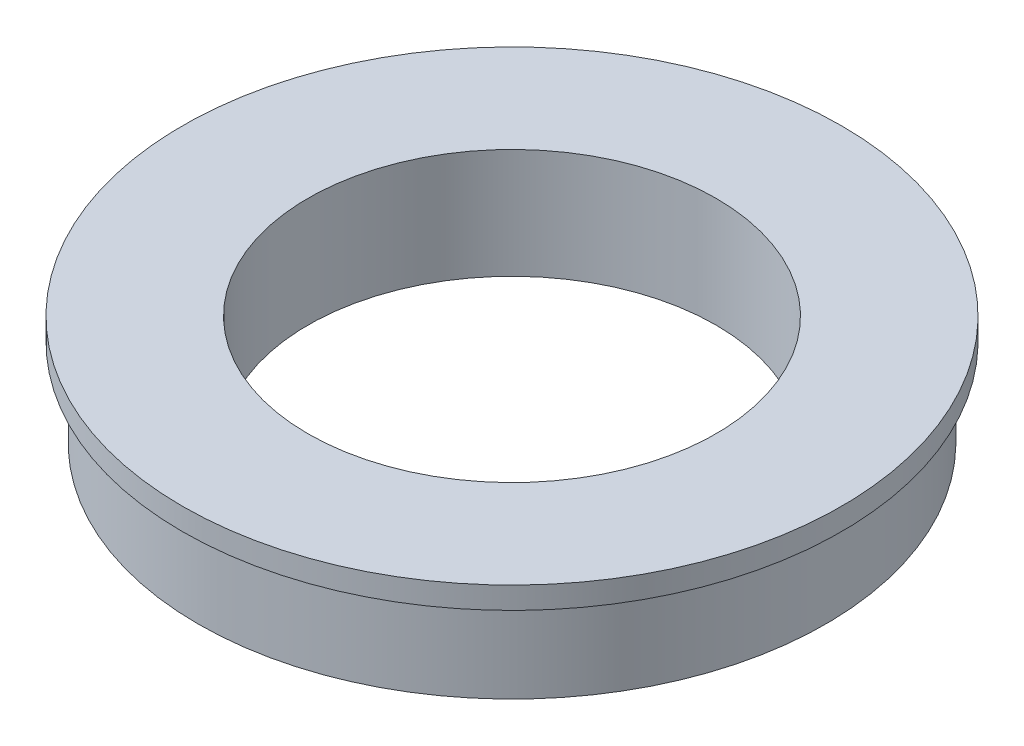
ISO-10303-21;
HEADER;
FILE_DESCRIPTION(('STEP AP214'),'2;1');
FILE_NAME('part.step','',(''),(''),'','','');
FILE_SCHEMA(('AUTOMOTIVE_DESIGN { 1 0 10303 214 1 1 1 1 }'));
ENDSEC;
DATA;
#1=APPLICATION_CONTEXT('core data for automotive mechanical design processes');
#2=APPLICATION_PROTOCOL_DEFINITION('international standard','automotive_design',2000,#1);
#3=PRODUCT_CONTEXT('',#1,'mechanical');
#4=PRODUCT('Part','Part','',(#3));
#5=PRODUCT_RELATED_PRODUCT_CATEGORY('part','',(#4));
#6=PRODUCT_DEFINITION_FORMATION('','',#4);
#7=PRODUCT_DEFINITION_CONTEXT('part definition',#1,'design');
#8=PRODUCT_DEFINITION('design','',#6,#7);
#9=PRODUCT_DEFINITION_SHAPE('','',#8);
#10=(LENGTH_UNIT() NAMED_UNIT(*) SI_UNIT(.MILLI.,.METRE.));
#11=(NAMED_UNIT(*) PLANE_ANGLE_UNIT() SI_UNIT($,.RADIAN.));
#12=(NAMED_UNIT(*) SI_UNIT($,.STERADIAN.) SOLID_ANGLE_UNIT());
#13=UNCERTAINTY_MEASURE_WITH_UNIT(LENGTH_MEASURE(1.E-05),#10,'distance_accuracy_value','');
#14=(GEOMETRIC_REPRESENTATION_CONTEXT(3) GLOBAL_UNCERTAINTY_ASSIGNED_CONTEXT((#13)) GLOBAL_UNIT_ASSIGNED_CONTEXT((#10,
#11,#12)) REPRESENTATION_CONTEXT('',''));
#15=CARTESIAN_POINT('',(0.,0.,0.));
#16=DIRECTION('',(0.,0.,1.));
#17=DIRECTION('',(1.,0.,0.));
#18=AXIS2_PLACEMENT_3D('',#15,#16,#17);
#19=CARTESIAN_POINT('',(0.,-3.5,0.));
#20=DIRECTION('',(0.,1.,0.));
#21=DIRECTION('',(0.,0.,1.));
#22=AXIS2_PLACEMENT_3D('',#19,#20,#21);
#23=PLANE('',#22);
#24=CARTESIAN_POINT('',(0.,-3.5,0.));
#25=DIRECTION('',(0.,1.,0.));
#26=DIRECTION('',(0.,0.,1.));
#27=AXIS2_PLACEMENT_3D('',#24,#25,#26);
#28=CIRCLE('',#27,6.5);
#29=CARTESIAN_POINT('',(0.,-3.5,6.50000000000001));
#30=VERTEX_POINT('',#29);
#31=EDGE_CURVE('E31',#30,#30,#28,.T.);
#32=ORIENTED_EDGE('',*,*,#31,.T.);
#33=EDGE_LOOP('',(#32));
#34=FACE_BOUND('',#33,.T.);
#35=CARTESIAN_POINT('',(0.,-3.5,0.));
#36=DIRECTION('',(0.,1.,0.));
#37=DIRECTION('',(0.,0.,1.));
#38=AXIS2_PLACEMENT_3D('',#35,#36,#37);
#39=CIRCLE('',#38,7.5);
#40=CARTESIAN_POINT('',(0.,-3.5,7.50000000000001));
#41=VERTEX_POINT('',#40);
#42=EDGE_CURVE('E54',#41,#41,#39,.T.);
#43=ORIENTED_EDGE('',*,*,#42,.F.);
#44=EDGE_LOOP('',(#43));
#45=FACE_BOUND('',#44,.T.);
#46=ADVANCED_FACE('F24',(#34,#45),#23,.F.);
#47=CARTESIAN_POINT('',(0.,-3.5,0.));
#48=DIRECTION('',(0.,1.,0.));
#49=DIRECTION('',(0.,0.,1.));
#50=AXIS2_PLACEMENT_3D('',#47,#48,#49);
#51=CYLINDRICAL_SURFACE('',#50,10.);
#52=CARTESIAN_POINT('',(0.,-3.5,0.));
#53=DIRECTION('',(0.,1.,0.));
#54=DIRECTION('',(0.,0.,1.));
#55=AXIS2_PLACEMENT_3D('',#52,#53,#54);
#56=CIRCLE('',#55,10.);
#57=CARTESIAN_POINT('',(0.,-3.5,10.));
#58=VERTEX_POINT('',#57);
#59=EDGE_CURVE('E10',#58,#58,#56,.T.);
#60=ORIENTED_EDGE('',*,*,#59,.T.);
#61=EDGE_LOOP('',(#60));
#62=FACE_BOUND('',#61,.T.);
#63=CARTESIAN_POINT('',(0.,-0.700000000000006,0.));
#64=DIRECTION('',(0.,1.,0.));
#65=DIRECTION('',(0.,0.,1.));
#66=AXIS2_PLACEMENT_3D('',#63,#64,#65);
#67=CIRCLE('',#66,10.);
#68=CARTESIAN_POINT('',(0.,-0.700000000000006,10.));
#69=VERTEX_POINT('',#68);
#70=EDGE_CURVE('E47',#69,#69,#67,.T.);
#71=ORIENTED_EDGE('',*,*,#70,.F.);
#72=EDGE_LOOP('',(#71));
#73=FACE_BOUND('',#72,.T.);
#74=ADVANCED_FACE('F26',(#62,#73),#51,.T.);
#75=CARTESIAN_POINT('',(0.,-3.5,0.));
#76=DIRECTION('',(0.,1.,0.));
#77=DIRECTION('',(0.,0.,1.));
#78=AXIS2_PLACEMENT_3D('',#75,#76,#77);
#79=CIRCLE('',#78,9.);
#80=CARTESIAN_POINT('',(0.,-3.5,9.00000000000001));
#81=VERTEX_POINT('',#80);
#82=EDGE_CURVE('E53',#81,#81,#79,.T.);
#83=ORIENTED_EDGE('',*,*,#82,.T.);
#84=EDGE_LOOP('',(#83));
#85=FACE_BOUND('',#84,.T.);
#86=ORIENTED_EDGE('',*,*,#59,.F.);
#87=EDGE_LOOP('',(#86));
#88=FACE_BOUND('',#87,.T.);
#89=ADVANCED_FACE('F77',(#85,#88),#23,.F.);
#90=CARTESIAN_POINT('',(0.,0.,0.));
#91=DIRECTION('',(0.,1.,0.));
#92=DIRECTION('',(0.,0.,1.));
#93=AXIS2_PLACEMENT_3D('',#90,#91,#92);
#94=PLANE('',#93);
#95=CARTESIAN_POINT('',(0.,0.,0.));
#96=DIRECTION('',(0.,1.,0.));
#97=DIRECTION('',(0.,0.,1.));
#98=AXIS2_PLACEMENT_3D('',#95,#96,#97);
#99=CIRCLE('',#98,6.5);
#100=CARTESIAN_POINT('',(0.,0.,6.50000000000001));
#101=VERTEX_POINT('',#100);
#102=EDGE_CURVE('E35',#101,#101,#99,.T.);
#103=ORIENTED_EDGE('',*,*,#102,.F.);
#104=EDGE_LOOP('',(#103));
#105=FACE_BOUND('',#104,.T.);
#106=CARTESIAN_POINT('',(0.,0.,0.));
#107=DIRECTION('',(0.,1.,0.));
#108=DIRECTION('',(0.,0.,1.));
#109=AXIS2_PLACEMENT_3D('',#106,#107,#108);
#110=CIRCLE('',#109,10.5);
#111=CARTESIAN_POINT('',(0.,0.,10.5));
#112=VERTEX_POINT('',#111);
#113=EDGE_CURVE('E44',#112,#112,#110,.T.);
#114=ORIENTED_EDGE('',*,*,#113,.T.);
#115=EDGE_LOOP('',(#114));
#116=FACE_BOUND('',#115,.T.);
#117=ADVANCED_FACE('F86',(#105,#116),#94,.T.);
#118=CARTESIAN_POINT('',(0.,-3.5,0.));
#119=DIRECTION('',(0.,1.,0.));
#120=DIRECTION('',(0.,0.,1.));
#121=AXIS2_PLACEMENT_3D('',#118,#119,#120);
#122=CYLINDRICAL_SURFACE('',#121,6.5);
#123=ORIENTED_EDGE('',*,*,#31,.F.);
#124=EDGE_LOOP('',(#123));
#125=FACE_BOUND('',#124,.T.);
#126=ORIENTED_EDGE('',*,*,#102,.T.);
#127=EDGE_LOOP('',(#126));
#128=FACE_BOUND('',#127,.T.);
#129=ADVANCED_FACE('F92',(#125,#128),#122,.F.);
#130=CARTESIAN_POINT('',(0.,-0.700000000000006,0.));
#131=DIRECTION('',(0.,1.,0.));
#132=DIRECTION('',(0.,0.,1.));
#133=AXIS2_PLACEMENT_3D('',#130,#131,#132);
#134=CYLINDRICAL_SURFACE('',#133,10.5);
#135=CARTESIAN_POINT('',(0.,-0.700000000000006,0.));
#136=DIRECTION('',(0.,1.,0.));
#137=DIRECTION('',(0.,0.,1.));
#138=AXIS2_PLACEMENT_3D('',#135,#136,#137);
#139=CIRCLE('',#138,10.5);
#140=CARTESIAN_POINT('',(0.,-0.700000000000006,10.5));
#141=VERTEX_POINT('',#140);
#142=EDGE_CURVE('E39',#141,#141,#139,.T.);
#143=ORIENTED_EDGE('',*,*,#142,.T.);
#144=EDGE_LOOP('',(#143));
#145=FACE_BOUND('',#144,.T.);
#146=ORIENTED_EDGE('',*,*,#113,.F.);
#147=EDGE_LOOP('',(#146));
#148=FACE_BOUND('',#147,.T.);
#149=ADVANCED_FACE('F104',(#145,#148),#134,.T.);
#150=CARTESIAN_POINT('',(0.,-0.700000000000006,0.));
#151=DIRECTION('',(0.,1.,0.));
#152=DIRECTION('',(0.,0.,1.));
#153=AXIS2_PLACEMENT_3D('',#150,#151,#152);
#154=PLANE('',#153);
#155=ORIENTED_EDGE('',*,*,#70,.T.);
#156=EDGE_LOOP('',(#155));
#157=FACE_BOUND('',#156,.T.);
#158=ORIENTED_EDGE('',*,*,#142,.F.);
#159=EDGE_LOOP('',(#158));
#160=FACE_BOUND('',#159,.T.);
#161=ADVANCED_FACE('F98',(#157,#160),#154,.F.);
#162=CARTESIAN_POINT('',(0.,-3.5,0.));
#163=DIRECTION('',(0.,1.,0.));
#164=DIRECTION('',(0.,0.,1.));
#165=AXIS2_PLACEMENT_3D('',#162,#163,#164);
#166=CYLINDRICAL_SURFACE('',#165,9.);
#167=ORIENTED_EDGE('',*,*,#82,.F.);
#168=EDGE_LOOP('',(#167));
#169=FACE_BOUND('',#168,.T.);
#170=CARTESIAN_POINT('',(0.,-1.,0.));
#171=DIRECTION('',(0.,1.,0.));
#172=DIRECTION('',(0.,0.,1.));
#173=AXIS2_PLACEMENT_3D('',#170,#171,#172);
#174=CIRCLE('',#173,9.);
#175=CARTESIAN_POINT('',(0.,-1.,9.00000000000001));
#176=VERTEX_POINT('',#175);
#177=EDGE_CURVE('E50',#176,#176,#174,.F.);
#178=ORIENTED_EDGE('',*,*,#177,.F.);
#179=EDGE_LOOP('',(#178));
#180=FACE_BOUND('',#179,.T.);
#181=ADVANCED_FACE('F72',(#169,#180),#166,.F.);
#182=CARTESIAN_POINT('',(0.,-1.,0.));
#183=DIRECTION('',(0.,1.,0.));
#184=DIRECTION('',(0.,0.,1.));
#185=AXIS2_PLACEMENT_3D('',#182,#183,#184);
#186=PLANE('',#185);
#187=ORIENTED_EDGE('',*,*,#177,.T.);
#188=EDGE_LOOP('',(#187));
#189=FACE_BOUND('',#188,.T.);
#190=CARTESIAN_POINT('',(0.,-1.,0.));
#191=DIRECTION('',(0.,1.,0.));
#192=DIRECTION('',(0.,0.,1.));
#193=AXIS2_PLACEMENT_3D('',#190,#191,#192);
#194=CIRCLE('',#193,7.5);
#195=CARTESIAN_POINT('',(0.,-1.,7.50000000000001));
#196=VERTEX_POINT('',#195);
#197=EDGE_CURVE('E57',#196,#196,#194,.T.);
#198=ORIENTED_EDGE('',*,*,#197,.T.);
#199=EDGE_LOOP('',(#198));
#200=FACE_BOUND('',#199,.T.);
#201=ADVANCED_FACE('F63',(#189,#200),#186,.F.);
#202=CARTESIAN_POINT('',(0.,-3.5,0.));
#203=DIRECTION('',(0.,1.,0.));
#204=DIRECTION('',(0.,0.,1.));
#205=AXIS2_PLACEMENT_3D('',#202,#203,#204);
#206=CYLINDRICAL_SURFACE('',#205,7.5);
#207=ORIENTED_EDGE('',*,*,#42,.T.);
#208=EDGE_LOOP('',(#207));
#209=FACE_BOUND('',#208,.T.);
#210=ORIENTED_EDGE('',*,*,#197,.F.);
#211=EDGE_LOOP('',(#210));
#212=FACE_BOUND('',#211,.T.);
#213=ADVANCED_FACE('F65',(#209,#212),#206,.T.);
#214=CLOSED_SHELL('',(#46,#74,#89,#117,#129,#149,#161,#181,#201,#213));
#215=MANIFOLD_SOLID_BREP('B2',#214);
#216=ADVANCED_BREP_SHAPE_REPRESENTATION('',(#18,#215),#14);
#217=SHAPE_DEFINITION_REPRESENTATION(#9,#216);
ENDSEC;
END-ISO-10303-21;
